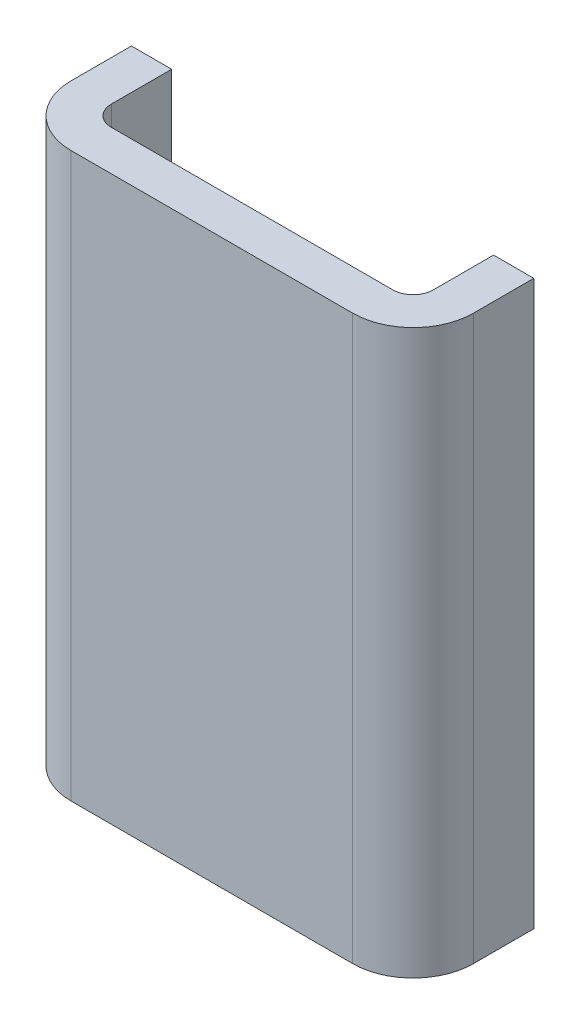
ISO-10303-21;
HEADER;
FILE_DESCRIPTION(('STEP AP214'),'2;1');
FILE_NAME('part.step','',(''),(''),'','','');
FILE_SCHEMA(('AUTOMOTIVE_DESIGN { 1 0 10303 214 1 1 1 1 }'));
ENDSEC;
DATA;
#1=APPLICATION_CONTEXT('core data for automotive mechanical design processes');
#2=APPLICATION_PROTOCOL_DEFINITION('international standard','automotive_design',2000,#1);
#3=PRODUCT_CONTEXT('',#1,'mechanical');
#4=PRODUCT('Part','Part','',(#3));
#5=PRODUCT_RELATED_PRODUCT_CATEGORY('part','',(#4));
#6=PRODUCT_DEFINITION_FORMATION('','',#4);
#7=PRODUCT_DEFINITION_CONTEXT('part definition',#1,'design');
#8=PRODUCT_DEFINITION('design','',#6,#7);
#9=PRODUCT_DEFINITION_SHAPE('','',#8);
#10=(LENGTH_UNIT() NAMED_UNIT(*) SI_UNIT(.MILLI.,.METRE.));
#11=(NAMED_UNIT(*) PLANE_ANGLE_UNIT() SI_UNIT($,.RADIAN.));
#12=(NAMED_UNIT(*) SI_UNIT($,.STERADIAN.) SOLID_ANGLE_UNIT());
#13=UNCERTAINTY_MEASURE_WITH_UNIT(LENGTH_MEASURE(1.E-05),#10,'distance_accuracy_value','');
#14=(GEOMETRIC_REPRESENTATION_CONTEXT(3) GLOBAL_UNCERTAINTY_ASSIGNED_CONTEXT((#13)) GLOBAL_UNIT_ASSIGNED_CONTEXT((#10,
#11,#12)) REPRESENTATION_CONTEXT('',''));
#15=CARTESIAN_POINT('',(0.,0.,0.));
#16=DIRECTION('',(0.,0.,1.));
#17=DIRECTION('',(1.,0.,0.));
#18=AXIS2_PLACEMENT_3D('',#15,#16,#17);
#19=CARTESIAN_POINT('',(0.,88.9,-12.7));
#20=DIRECTION('',(0.,0.,1.));
#21=DIRECTION('',(1.,0.,0.));
#22=AXIS2_PLACEMENT_3D('',#19,#20,#21);
#23=PLANE('',#22);
#24=DIRECTION('',(0.,-1.,0.));
#25=VECTOR('',#24,1.);
#26=CARTESIAN_POINT('',(50.8,88.9,-12.7));
#27=LINE('',#26,#25);
#28=CARTESIAN_POINT('',(50.8,88.9,-12.7));
#29=VERTEX_POINT('',#28);
#30=CARTESIAN_POINT('',(50.8,0.,-12.7));
#31=VERTEX_POINT('',#30);
#32=EDGE_CURVE('E178',#29,#31,#27,.T.);
#33=ORIENTED_EDGE('',*,*,#32,.F.);
#34=DIRECTION('',(-1.,0.,0.));
#35=VECTOR('',#34,1.);
#36=CARTESIAN_POINT('',(0.,88.9,-12.7));
#37=LINE('',#36,#35);
#38=CARTESIAN_POINT('',(57.15,88.9,-12.7));
#39=VERTEX_POINT('',#38);
#40=EDGE_CURVE('E175',#39,#29,#37,.T.);
#41=ORIENTED_EDGE('',*,*,#40,.F.);
#42=DIRECTION('',(0.,-1.,0.));
#43=VECTOR('',#42,1.);
#44=CARTESIAN_POINT('',(57.15,88.9,-12.7));
#45=LINE('',#44,#43);
#46=CARTESIAN_POINT('',(57.15,0.,-12.7));
#47=VERTEX_POINT('',#46);
#48=EDGE_CURVE('E144',#39,#47,#45,.T.);
#49=ORIENTED_EDGE('',*,*,#48,.T.);
#50=DIRECTION('',(-1.,0.,0.));
#51=VECTOR('',#50,1.);
#52=CARTESIAN_POINT('',(0.,0.,-12.7));
#53=LINE('',#52,#51);
#54=EDGE_CURVE('E187',#47,#31,#53,.T.);
#55=ORIENTED_EDGE('',*,*,#54,.T.);
#56=EDGE_LOOP('',(#33,#41,#49,#55));
#57=FACE_BOUND('',#56,.T.);
#58=ADVANCED_FACE('F42',(#57),#23,.F.);
#59=CARTESIAN_POINT('',(0.,0.,0.));
#60=DIRECTION('',(0.,-1.,0.));
#61=DIRECTION('',(0.,0.,-1.));
#62=AXIS2_PLACEMENT_3D('',#59,#60,#61);
#63=PLANE('',#62);
#64=CARTESIAN_POINT('',(47.625,0.,-3.175));
#65=DIRECTION('',(0.,-1.,0.));
#66=DIRECTION('',(0.,0.,-1.));
#67=AXIS2_PLACEMENT_3D('',#64,#65,#66);
#68=CIRCLE('',#67,3.175);
#69=CARTESIAN_POINT('',(50.8,0.,-3.175));
#70=VERTEX_POINT('',#69);
#71=CARTESIAN_POINT('',(47.625,0.,0.));
#72=VERTEX_POINT('',#71);
#73=EDGE_CURVE('E260',#70,#72,#68,.T.);
#74=ORIENTED_EDGE('',*,*,#73,.F.);
#75=DIRECTION('',(0.,0.,-1.));
#76=VECTOR('',#75,1.);
#77=CARTESIAN_POINT('',(50.8,0.,0.));
#78=LINE('',#77,#76);
#79=EDGE_CURVE('E245',#70,#31,#78,.T.);
#80=ORIENTED_EDGE('',*,*,#79,.T.);
#81=ORIENTED_EDGE('',*,*,#54,.F.);
#82=DIRECTION('',(0.,0.,-1.));
#83=VECTOR('',#82,1.);
#84=CARTESIAN_POINT('',(57.15,0.,0.));
#85=LINE('',#84,#83);
#86=CARTESIAN_POINT('',(57.15,0.,-3.175));
#87=VERTEX_POINT('',#86);
#88=EDGE_CURVE('E148',#87,#47,#85,.T.);
#89=ORIENTED_EDGE('',*,*,#88,.F.);
#90=CARTESIAN_POINT('',(47.625,0.,-3.175));
#91=DIRECTION('',(0.,-1.,0.));
#92=DIRECTION('',(0.,0.,-1.));
#93=AXIS2_PLACEMENT_3D('',#90,#91,#92);
#94=CIRCLE('',#93,9.525);
#95=CARTESIAN_POINT('',(47.625,0.,6.35));
#96=VERTEX_POINT('',#95);
#97=EDGE_CURVE('E112',#87,#96,#94,.T.);
#98=ORIENTED_EDGE('',*,*,#97,.T.);
#99=DIRECTION('',(1.,0.,0.));
#100=VECTOR('',#99,1.);
#101=CARTESIAN_POINT('',(0.,0.,6.35));
#102=LINE('',#101,#100);
#103=CARTESIAN_POINT('',(3.175,0.,6.35));
#104=VERTEX_POINT('',#103);
#105=EDGE_CURVE('E107',#104,#96,#102,.T.);
#106=ORIENTED_EDGE('',*,*,#105,.F.);
#107=CARTESIAN_POINT('',(3.175,0.,-3.175));
#108=DIRECTION('',(0.,-1.,0.));
#109=DIRECTION('',(0.,0.,-1.));
#110=AXIS2_PLACEMENT_3D('',#107,#108,#109);
#111=CIRCLE('',#110,9.525);
#112=CARTESIAN_POINT('',(-6.35,0.,-3.175));
#113=VERTEX_POINT('',#112);
#114=EDGE_CURVE('E46',#104,#113,#111,.T.);
#115=ORIENTED_EDGE('',*,*,#114,.T.);
#116=DIRECTION('',(0.,0.,1.));
#117=VECTOR('',#116,1.);
#118=CARTESIAN_POINT('',(-6.35,0.,0.));
#119=LINE('',#118,#117);
#120=CARTESIAN_POINT('',(-6.35,0.,-12.7));
#121=VERTEX_POINT('',#120);
#122=EDGE_CURVE('E105',#121,#113,#119,.T.);
#123=ORIENTED_EDGE('',*,*,#122,.F.);
#124=CARTESIAN_POINT('',(0.,0.,-12.7));
#125=VERTEX_POINT('',#124);
#126=EDGE_CURVE('E151',#125,#121,#53,.T.);
#127=ORIENTED_EDGE('',*,*,#126,.F.);
#128=DIRECTION('',(0.,0.,1.));
#129=VECTOR('',#128,1.);
#130=CARTESIAN_POINT('',(0.,0.,0.));
#131=LINE('',#130,#129);
#132=CARTESIAN_POINT('',(0.,0.,-3.175));
#133=VERTEX_POINT('',#132);
#134=EDGE_CURVE('E206',#125,#133,#131,.T.);
#135=ORIENTED_EDGE('',*,*,#134,.T.);
#136=CARTESIAN_POINT('',(3.175,0.,-3.175));
#137=DIRECTION('',(0.,-1.,0.));
#138=DIRECTION('',(0.,0.,-1.));
#139=AXIS2_PLACEMENT_3D('',#136,#137,#138);
#140=CIRCLE('',#139,3.175);
#141=CARTESIAN_POINT('',(3.175,0.,0.));
#142=VERTEX_POINT('',#141);
#143=EDGE_CURVE('E237',#142,#133,#140,.T.);
#144=ORIENTED_EDGE('',*,*,#143,.F.);
#145=DIRECTION('',(1.,0.,0.));
#146=VECTOR('',#145,1.);
#147=CARTESIAN_POINT('',(0.,0.,0.));
#148=LINE('',#147,#146);
#149=EDGE_CURVE('E276',#142,#72,#148,.T.);
#150=ORIENTED_EDGE('',*,*,#149,.T.);
#151=EDGE_LOOP('',(#74,#80,#81,#89,#98,#106,#115,#123,#127,#135,#144,#150));
#152=FACE_BOUND('',#151,.T.);
#153=ADVANCED_FACE('F103',(#152),#63,.T.);
#154=CARTESIAN_POINT('',(-6.35,88.9,0.));
#155=DIRECTION('',(1.,0.,0.));
#156=DIRECTION('',(0.,0.,-1.));
#157=AXIS2_PLACEMENT_3D('',#154,#155,#156);
#158=PLANE('',#157);
#159=ORIENTED_EDGE('',*,*,#122,.T.);
#160=DIRECTION('',(0.,1.,0.));
#161=VECTOR('',#160,1.);
#162=CARTESIAN_POINT('',(-6.35,88.9,-3.175));
#163=LINE('',#162,#161);
#164=CARTESIAN_POINT('',(-6.35,88.9,-3.175));
#165=VERTEX_POINT('',#164);
#166=EDGE_CURVE('E11',#113,#165,#163,.T.);
#167=ORIENTED_EDGE('',*,*,#166,.T.);
#168=DIRECTION('',(0.,0.,1.));
#169=VECTOR('',#168,1.);
#170=CARTESIAN_POINT('',(-6.35,88.9,0.));
#171=LINE('',#170,#169);
#172=CARTESIAN_POINT('',(-6.35,88.9,-12.7));
#173=VERTEX_POINT('',#172);
#174=EDGE_CURVE('E135',#173,#165,#171,.T.);
#175=ORIENTED_EDGE('',*,*,#174,.F.);
#176=DIRECTION('',(0.,-1.,0.));
#177=VECTOR('',#176,1.);
#178=CARTESIAN_POINT('',(-6.35,88.9,-12.7));
#179=LINE('',#178,#177);
#180=EDGE_CURVE('E117',#173,#121,#179,.T.);
#181=ORIENTED_EDGE('',*,*,#180,.T.);
#182=EDGE_LOOP('',(#159,#167,#175,#181));
#183=FACE_BOUND('',#182,.T.);
#184=ADVANCED_FACE('F115',(#183),#158,.F.);
#185=CARTESIAN_POINT('',(0.,88.9,6.35));
#186=DIRECTION('',(0.,0.,-1.));
#187=DIRECTION('',(-1.,0.,0.));
#188=AXIS2_PLACEMENT_3D('',#185,#186,#187);
#189=PLANE('',#188);
#190=ORIENTED_EDGE('',*,*,#105,.T.);
#191=DIRECTION('',(0.,1.,0.));
#192=VECTOR('',#191,1.);
#193=CARTESIAN_POINT('',(47.625,88.9,6.35));
#194=LINE('',#193,#192);
#195=CARTESIAN_POINT('',(47.625,88.9,6.35));
#196=VERTEX_POINT('',#195);
#197=EDGE_CURVE('E127',#96,#196,#194,.T.);
#198=ORIENTED_EDGE('',*,*,#197,.T.);
#199=DIRECTION('',(1.,0.,0.));
#200=VECTOR('',#199,1.);
#201=CARTESIAN_POINT('',(0.,88.9,6.35));
#202=LINE('',#201,#200);
#203=CARTESIAN_POINT('',(3.175,88.9,6.35));
#204=VERTEX_POINT('',#203);
#205=EDGE_CURVE('E137',#204,#196,#202,.T.);
#206=ORIENTED_EDGE('',*,*,#205,.F.);
#207=DIRECTION('',(0.,1.,0.));
#208=VECTOR('',#207,1.);
#209=CARTESIAN_POINT('',(3.175,88.9,6.35));
#210=LINE('',#209,#208);
#211=EDGE_CURVE('E122',#204,#104,#210,.F.);
#212=ORIENTED_EDGE('',*,*,#211,.T.);
#213=EDGE_LOOP('',(#190,#198,#206,#212));
#214=FACE_BOUND('',#213,.T.);
#215=ADVANCED_FACE('F156',(#214),#189,.F.);
#216=CARTESIAN_POINT('',(57.15,88.9,0.));
#217=DIRECTION('',(-1.,0.,0.));
#218=DIRECTION('',(0.,0.,1.));
#219=AXIS2_PLACEMENT_3D('',#216,#217,#218);
#220=PLANE('',#219);
#221=DIRECTION('',(0.,0.,-1.));
#222=VECTOR('',#221,1.);
#223=CARTESIAN_POINT('',(57.15,88.9,0.));
#224=LINE('',#223,#222);
#225=CARTESIAN_POINT('',(57.15,88.9,-3.175));
#226=VERTEX_POINT('',#225);
#227=EDGE_CURVE('E139',#226,#39,#224,.T.);
#228=ORIENTED_EDGE('',*,*,#227,.F.);
#229=DIRECTION('',(0.,1.,0.));
#230=VECTOR('',#229,1.);
#231=CARTESIAN_POINT('',(57.15,88.9,-3.175));
#232=LINE('',#231,#230);
#233=EDGE_CURVE('E113',#226,#87,#232,.F.);
#234=ORIENTED_EDGE('',*,*,#233,.T.);
#235=ORIENTED_EDGE('',*,*,#88,.T.);
#236=ORIENTED_EDGE('',*,*,#48,.F.);
#237=EDGE_LOOP('',(#228,#234,#235,#236));
#238=FACE_BOUND('',#237,.T.);
#239=ADVANCED_FACE('F168',(#238),#220,.F.);
#240=CARTESIAN_POINT('',(0.,88.9,-12.7));
#241=VERTEX_POINT('',#240);
#242=EDGE_CURVE('E143',#241,#173,#37,.T.);
#243=ORIENTED_EDGE('',*,*,#242,.F.);
#244=DIRECTION('',(0.,-1.,0.));
#245=VECTOR('',#244,1.);
#246=CARTESIAN_POINT('',(0.,88.9,-12.7));
#247=LINE('',#246,#245);
#248=EDGE_CURVE('E203',#241,#125,#247,.T.);
#249=ORIENTED_EDGE('',*,*,#248,.T.);
#250=ORIENTED_EDGE('',*,*,#126,.T.);
#251=ORIENTED_EDGE('',*,*,#180,.F.);
#252=EDGE_LOOP('',(#243,#249,#250,#251));
#253=FACE_BOUND('',#252,.T.);
#254=ADVANCED_FACE('F200',(#253),#23,.F.);
#255=CARTESIAN_POINT('',(0.,88.9,0.));
#256=DIRECTION('',(0.,-1.,0.));
#257=DIRECTION('',(0.,0.,-1.));
#258=AXIS2_PLACEMENT_3D('',#255,#256,#257);
#259=PLANE('',#258);
#260=DIRECTION('',(0.,0.,-1.));
#261=VECTOR('',#260,1.);
#262=CARTESIAN_POINT('',(50.8,88.9,0.));
#263=LINE('',#262,#261);
#264=CARTESIAN_POINT('',(50.8,88.9,-3.175));
#265=VERTEX_POINT('',#264);
#266=EDGE_CURVE('E272',#265,#29,#263,.T.);
#267=ORIENTED_EDGE('',*,*,#266,.F.);
#268=CARTESIAN_POINT('',(47.625,88.9,-3.175));
#269=DIRECTION('',(0.,-1.,0.));
#270=DIRECTION('',(0.,0.,-1.));
#271=AXIS2_PLACEMENT_3D('',#268,#269,#270);
#272=CIRCLE('',#271,3.175);
#273=CARTESIAN_POINT('',(47.625,88.9,0.));
#274=VERTEX_POINT('',#273);
#275=EDGE_CURVE('E239',#274,#265,#272,.F.);
#276=ORIENTED_EDGE('',*,*,#275,.F.);
#277=DIRECTION('',(1.,0.,0.));
#278=VECTOR('',#277,1.);
#279=CARTESIAN_POINT('',(0.,88.9,0.));
#280=LINE('',#279,#278);
#281=CARTESIAN_POINT('',(3.175,88.9,0.));
#282=VERTEX_POINT('',#281);
#283=EDGE_CURVE('E244',#282,#274,#280,.T.);
#284=ORIENTED_EDGE('',*,*,#283,.F.);
#285=CARTESIAN_POINT('',(3.175,88.9,-3.175));
#286=DIRECTION('',(0.,-1.,0.));
#287=DIRECTION('',(0.,0.,-1.));
#288=AXIS2_PLACEMENT_3D('',#285,#286,#287);
#289=CIRCLE('',#288,3.175);
#290=CARTESIAN_POINT('',(0.,88.9,-3.175));
#291=VERTEX_POINT('',#290);
#292=EDGE_CURVE('E235',#291,#282,#289,.F.);
#293=ORIENTED_EDGE('',*,*,#292,.F.);
#294=DIRECTION('',(0.,0.,1.));
#295=VECTOR('',#294,1.);
#296=CARTESIAN_POINT('',(0.,88.9,0.));
#297=LINE('',#296,#295);
#298=EDGE_CURVE('E241',#241,#291,#297,.T.);
#299=ORIENTED_EDGE('',*,*,#298,.F.);
#300=ORIENTED_EDGE('',*,*,#242,.T.);
#301=ORIENTED_EDGE('',*,*,#174,.T.);
#302=CARTESIAN_POINT('',(3.175,88.9,-3.175));
#303=DIRECTION('',(0.,-1.,0.));
#304=DIRECTION('',(0.,0.,-1.));
#305=AXIS2_PLACEMENT_3D('',#302,#303,#304);
#306=CIRCLE('',#305,9.525);
#307=EDGE_CURVE('E121',#165,#204,#306,.F.);
#308=ORIENTED_EDGE('',*,*,#307,.T.);
#309=ORIENTED_EDGE('',*,*,#205,.T.);
#310=CARTESIAN_POINT('',(47.625,88.9,-3.175));
#311=DIRECTION('',(0.,-1.,0.));
#312=DIRECTION('',(0.,0.,-1.));
#313=AXIS2_PLACEMENT_3D('',#310,#311,#312);
#314=CIRCLE('',#313,9.525);
#315=EDGE_CURVE('E52',#196,#226,#314,.F.);
#316=ORIENTED_EDGE('',*,*,#315,.T.);
#317=ORIENTED_EDGE('',*,*,#227,.T.);
#318=ORIENTED_EDGE('',*,*,#40,.T.);
#319=EDGE_LOOP('',(#267,#276,#284,#293,#299,#300,#301,#308,#309,#316,#317,#318));
#320=FACE_BOUND('',#319,.T.);
#321=ADVANCED_FACE('F164',(#320),#259,.F.);
#322=CARTESIAN_POINT('',(47.625,88.9,-3.175));
#323=DIRECTION('',(0.,-1.,0.));
#324=DIRECTION('',(0.,0.,-1.));
#325=AXIS2_PLACEMENT_3D('',#322,#323,#324);
#326=CYLINDRICAL_SURFACE('',#325,9.525);
#327=ORIENTED_EDGE('',*,*,#315,.F.);
#328=ORIENTED_EDGE('',*,*,#197,.F.);
#329=ORIENTED_EDGE('',*,*,#97,.F.);
#330=ORIENTED_EDGE('',*,*,#233,.F.);
#331=EDGE_LOOP('',(#327,#328,#329,#330));
#332=FACE_BOUND('',#331,.T.);
#333=ADVANCED_FACE('F159',(#332),#326,.T.);
#334=CARTESIAN_POINT('',(3.175,88.9,-3.175));
#335=DIRECTION('',(0.,-1.,0.));
#336=DIRECTION('',(0.,0.,-1.));
#337=AXIS2_PLACEMENT_3D('',#334,#335,#336);
#338=CYLINDRICAL_SURFACE('',#337,9.525);
#339=ORIENTED_EDGE('',*,*,#307,.F.);
#340=ORIENTED_EDGE('',*,*,#166,.F.);
#341=ORIENTED_EDGE('',*,*,#114,.F.);
#342=ORIENTED_EDGE('',*,*,#211,.F.);
#343=EDGE_LOOP('',(#339,#340,#341,#342));
#344=FACE_BOUND('',#343,.T.);
#345=ADVANCED_FACE('F44',(#344),#338,.T.);
#346=CARTESIAN_POINT('',(0.,88.9,0.));
#347=DIRECTION('',(1.,0.,0.));
#348=DIRECTION('',(0.,0.,-1.));
#349=AXIS2_PLACEMENT_3D('',#346,#347,#348);
#350=PLANE('',#349);
#351=ORIENTED_EDGE('',*,*,#134,.F.);
#352=ORIENTED_EDGE('',*,*,#248,.F.);
#353=ORIENTED_EDGE('',*,*,#298,.T.);
#354=DIRECTION('',(0.,-1.,0.));
#355=VECTOR('',#354,1.);
#356=CARTESIAN_POINT('',(0.,88.9,-3.175));
#357=LINE('',#356,#355);
#358=EDGE_CURVE('E60',#133,#291,#357,.F.);
#359=ORIENTED_EDGE('',*,*,#358,.F.);
#360=EDGE_LOOP('',(#351,#352,#353,#359));
#361=FACE_BOUND('',#360,.T.);
#362=ADVANCED_FACE('F242',(#361),#350,.T.);
#363=CARTESIAN_POINT('',(0.,88.9,0.));
#364=DIRECTION('',(0.,0.,-1.));
#365=DIRECTION('',(-1.,0.,0.));
#366=AXIS2_PLACEMENT_3D('',#363,#364,#365);
#367=PLANE('',#366);
#368=ORIENTED_EDGE('',*,*,#149,.F.);
#369=DIRECTION('',(0.,-1.,0.));
#370=VECTOR('',#369,1.);
#371=CARTESIAN_POINT('',(3.175,88.9,0.));
#372=LINE('',#371,#370);
#373=EDGE_CURVE('E255',#282,#142,#372,.T.);
#374=ORIENTED_EDGE('',*,*,#373,.F.);
#375=ORIENTED_EDGE('',*,*,#283,.T.);
#376=DIRECTION('',(0.,-1.,0.));
#377=VECTOR('',#376,1.);
#378=CARTESIAN_POINT('',(47.625,88.9,0.));
#379=LINE('',#378,#377);
#380=EDGE_CURVE('E251',#72,#274,#379,.F.);
#381=ORIENTED_EDGE('',*,*,#380,.F.);
#382=EDGE_LOOP('',(#368,#374,#375,#381));
#383=FACE_BOUND('',#382,.T.);
#384=ADVANCED_FACE('F288',(#383),#367,.T.);
#385=CARTESIAN_POINT('',(50.8,88.9,0.));
#386=DIRECTION('',(-1.,0.,0.));
#387=DIRECTION('',(0.,0.,1.));
#388=AXIS2_PLACEMENT_3D('',#385,#386,#387);
#389=PLANE('',#388);
#390=ORIENTED_EDGE('',*,*,#266,.T.);
#391=ORIENTED_EDGE('',*,*,#32,.T.);
#392=ORIENTED_EDGE('',*,*,#79,.F.);
#393=DIRECTION('',(0.,-1.,0.));
#394=VECTOR('',#393,1.);
#395=CARTESIAN_POINT('',(50.8,88.9,-3.175));
#396=LINE('',#395,#394);
#397=EDGE_CURVE('E265',#265,#70,#396,.T.);
#398=ORIENTED_EDGE('',*,*,#397,.F.);
#399=EDGE_LOOP('',(#390,#391,#392,#398));
#400=FACE_BOUND('',#399,.T.);
#401=ADVANCED_FACE('F294',(#400),#389,.T.);
#402=CARTESIAN_POINT('',(47.625,88.9,-3.175));
#403=DIRECTION('',(0.,-1.,0.));
#404=DIRECTION('',(0.,0.,-1.));
#405=AXIS2_PLACEMENT_3D('',#402,#403,#404);
#406=CYLINDRICAL_SURFACE('',#405,3.175);
#407=ORIENTED_EDGE('',*,*,#275,.T.);
#408=ORIENTED_EDGE('',*,*,#397,.T.);
#409=ORIENTED_EDGE('',*,*,#73,.T.);
#410=ORIENTED_EDGE('',*,*,#380,.T.);
#411=EDGE_LOOP('',(#407,#408,#409,#410));
#412=FACE_BOUND('',#411,.T.);
#413=ADVANCED_FACE('F291',(#412),#406,.F.);
#414=CARTESIAN_POINT('',(3.175,88.9,-3.175));
#415=DIRECTION('',(0.,-1.,0.));
#416=DIRECTION('',(0.,0.,-1.));
#417=AXIS2_PLACEMENT_3D('',#414,#415,#416);
#418=CYLINDRICAL_SURFACE('',#417,3.175);
#419=ORIENTED_EDGE('',*,*,#292,.T.);
#420=ORIENTED_EDGE('',*,*,#373,.T.);
#421=ORIENTED_EDGE('',*,*,#143,.T.);
#422=ORIENTED_EDGE('',*,*,#358,.T.);
#423=EDGE_LOOP('',(#419,#420,#421,#422));
#424=FACE_BOUND('',#423,.T.);
#425=ADVANCED_FACE('F233',(#424),#418,.F.);
#426=CLOSED_SHELL('',(#58,#153,#184,#215,#239,#254,#321,#333,#345,#362,#384,#401,#413,#425));
#427=MANIFOLD_SOLID_BREP('B2',#426);
#428=ADVANCED_BREP_SHAPE_REPRESENTATION('',(#18,#427),#14);
#429=SHAPE_DEFINITION_REPRESENTATION(#9,#428);
ENDSEC;
END-ISO-10303-21;
